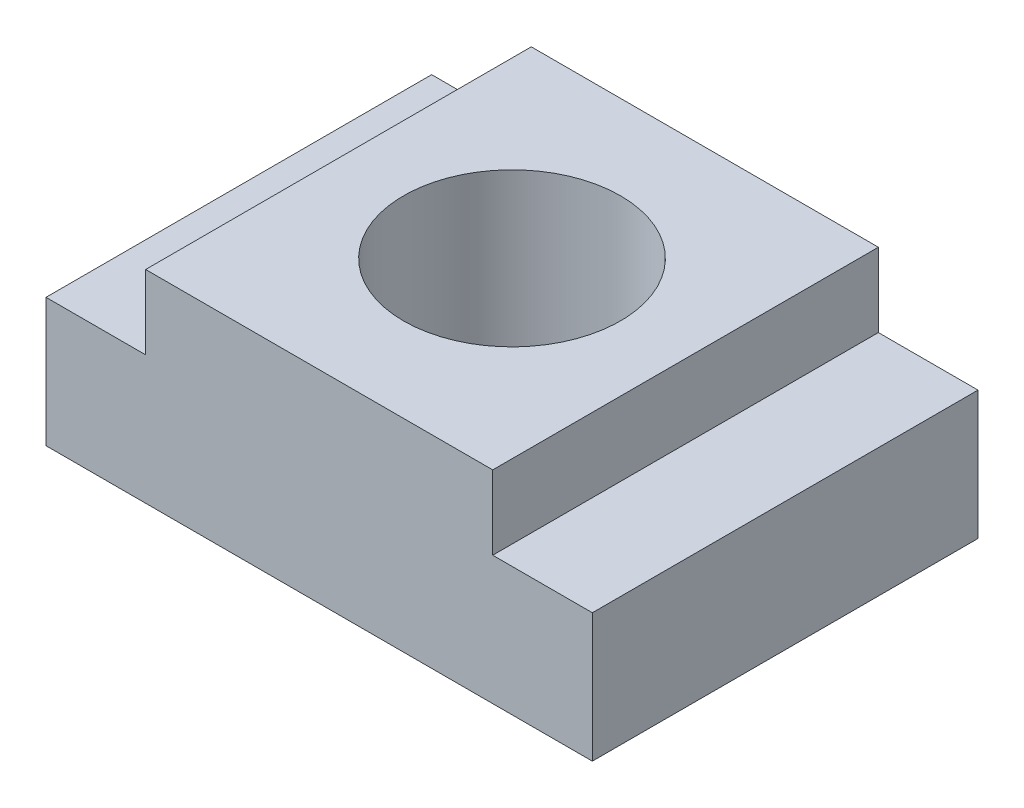
ISO-10303-21;
HEADER;
FILE_DESCRIPTION(('STEP AP214'),'2;1');
FILE_NAME('part.step','',(''),(''),'','','');
FILE_SCHEMA(('AUTOMOTIVE_DESIGN { 1 0 10303 214 1 1 1 1 }'));
ENDSEC;
DATA;
#1=APPLICATION_CONTEXT('core data for automotive mechanical design processes');
#2=APPLICATION_PROTOCOL_DEFINITION('international standard','automotive_design',2000,#1);
#3=PRODUCT_CONTEXT('',#1,'mechanical');
#4=PRODUCT('Part','Part','',(#3));
#5=PRODUCT_RELATED_PRODUCT_CATEGORY('part','',(#4));
#6=PRODUCT_DEFINITION_FORMATION('','',#4);
#7=PRODUCT_DEFINITION_CONTEXT('part definition',#1,'design');
#8=PRODUCT_DEFINITION('design','',#6,#7);
#9=PRODUCT_DEFINITION_SHAPE('','',#8);
#10=(LENGTH_UNIT() NAMED_UNIT(*) SI_UNIT(.MILLI.,.METRE.));
#11=(NAMED_UNIT(*) PLANE_ANGLE_UNIT() SI_UNIT($,.RADIAN.));
#12=(NAMED_UNIT(*) SI_UNIT($,.STERADIAN.) SOLID_ANGLE_UNIT());
#13=UNCERTAINTY_MEASURE_WITH_UNIT(LENGTH_MEASURE(1.E-05),#10,'distance_accuracy_value','');
#14=(GEOMETRIC_REPRESENTATION_CONTEXT(3) GLOBAL_UNCERTAINTY_ASSIGNED_CONTEXT((#13)) GLOBAL_UNIT_ASSIGNED_CONTEXT((#10,
#11,#12)) REPRESENTATION_CONTEXT('',''));
#15=CARTESIAN_POINT('',(0.,0.,0.));
#16=DIRECTION('',(0.,0.,1.));
#17=DIRECTION('',(1.,0.,0.));
#18=AXIS2_PLACEMENT_3D('',#15,#16,#17);
#19=CARTESIAN_POINT('',(8.5,0.,12.));
#20=DIRECTION('',(0.,1.,0.));
#21=DIRECTION('',(0.,0.,1.));
#22=AXIS2_PLACEMENT_3D('',#19,#20,#21);
#23=PLANE('',#22);
#24=CARTESIAN_POINT('',(0.,0.,6.));
#25=DIRECTION('',(0.,1.,0.));
#26=DIRECTION('',(0.,0.,1.));
#27=AXIS2_PLACEMENT_3D('',#24,#25,#26);
#28=CIRCLE('',#27,3.375);
#29=CARTESIAN_POINT('',(0.,0.,9.375));
#30=VERTEX_POINT('',#29);
#31=EDGE_CURVE('E136',#30,#30,#28,.T.);
#32=ORIENTED_EDGE('',*,*,#31,.T.);
#33=EDGE_LOOP('',(#32));
#34=FACE_BOUND('',#33,.T.);
#35=DIRECTION('',(1.,0.,0.));
#36=VECTOR('',#35,1.);
#37=CARTESIAN_POINT('',(8.5,0.,0.));
#38=LINE('',#37,#36);
#39=CARTESIAN_POINT('',(-8.5,0.,0.));
#40=VERTEX_POINT('',#39);
#41=CARTESIAN_POINT('',(8.5,0.,0.));
#42=VERTEX_POINT('',#41);
#43=EDGE_CURVE('E123',#40,#42,#38,.T.);
#44=ORIENTED_EDGE('',*,*,#43,.T.);
#45=DIRECTION('',(0.,0.,-1.));
#46=VECTOR('',#45,1.);
#47=CARTESIAN_POINT('',(8.5,0.,12.));
#48=LINE('',#47,#46);
#49=CARTESIAN_POINT('',(8.5,0.,12.));
#50=VERTEX_POINT('',#49);
#51=EDGE_CURVE('E11',#50,#42,#48,.T.);
#52=ORIENTED_EDGE('',*,*,#51,.F.);
#53=DIRECTION('',(1.,0.,0.));
#54=VECTOR('',#53,1.);
#55=CARTESIAN_POINT('',(8.5,0.,12.));
#56=LINE('',#55,#54);
#57=CARTESIAN_POINT('',(-8.5,0.,12.));
#58=VERTEX_POINT('',#57);
#59=EDGE_CURVE('E80',#58,#50,#56,.T.);
#60=ORIENTED_EDGE('',*,*,#59,.F.);
#61=DIRECTION('',(0.,0.,-1.));
#62=VECTOR('',#61,1.);
#63=CARTESIAN_POINT('',(-8.5,0.,12.));
#64=LINE('',#63,#62);
#65=EDGE_CURVE('E141',#58,#40,#64,.T.);
#66=ORIENTED_EDGE('',*,*,#65,.T.);
#67=EDGE_LOOP('',(#44,#52,#60,#66));
#68=FACE_BOUND('',#67,.T.);
#69=ADVANCED_FACE('F33',(#34,#68),#23,.F.);
#70=CARTESIAN_POINT('',(8.5,4.,12.));
#71=DIRECTION('',(-1.,0.,0.));
#72=DIRECTION('',(0.,0.,1.));
#73=AXIS2_PLACEMENT_3D('',#70,#71,#72);
#74=PLANE('',#73);
#75=DIRECTION('',(0.,1.,0.));
#76=VECTOR('',#75,1.);
#77=CARTESIAN_POINT('',(8.5,4.,0.));
#78=LINE('',#77,#76);
#79=CARTESIAN_POINT('',(8.5,4.,0.));
#80=VERTEX_POINT('',#79);
#81=EDGE_CURVE('E158',#42,#80,#78,.T.);
#82=ORIENTED_EDGE('',*,*,#81,.T.);
#83=DIRECTION('',(0.,0.,-1.));
#84=VECTOR('',#83,1.);
#85=CARTESIAN_POINT('',(8.5,4.,12.));
#86=LINE('',#85,#84);
#87=CARTESIAN_POINT('',(8.5,4.,12.));
#88=VERTEX_POINT('',#87);
#89=EDGE_CURVE('E41',#88,#80,#86,.T.);
#90=ORIENTED_EDGE('',*,*,#89,.F.);
#91=DIRECTION('',(0.,1.,0.));
#92=VECTOR('',#91,1.);
#93=CARTESIAN_POINT('',(8.5,4.,12.));
#94=LINE('',#93,#92);
#95=EDGE_CURVE('E152',#50,#88,#94,.T.);
#96=ORIENTED_EDGE('',*,*,#95,.F.);
#97=ORIENTED_EDGE('',*,*,#51,.T.);
#98=EDGE_LOOP('',(#82,#90,#96,#97));
#99=FACE_BOUND('',#98,.T.);
#100=ADVANCED_FACE('F181',(#99),#74,.F.);
#101=CARTESIAN_POINT('',(5.4,4.,12.));
#102=DIRECTION('',(0.,-1.,0.));
#103=DIRECTION('',(0.,0.,-1.));
#104=AXIS2_PLACEMENT_3D('',#101,#102,#103);
#105=PLANE('',#104);
#106=DIRECTION('',(-1.,0.,0.));
#107=VECTOR('',#106,1.);
#108=CARTESIAN_POINT('',(5.4,4.,0.));
#109=LINE('',#108,#107);
#110=CARTESIAN_POINT('',(5.4,4.,0.));
#111=VERTEX_POINT('',#110);
#112=EDGE_CURVE('E67',#80,#111,#109,.T.);
#113=ORIENTED_EDGE('',*,*,#112,.T.);
#114=DIRECTION('',(0.,0.,-1.));
#115=VECTOR('',#114,1.);
#116=CARTESIAN_POINT('',(5.4,4.,12.));
#117=LINE('',#116,#115);
#118=CARTESIAN_POINT('',(5.4,4.,12.));
#119=VERTEX_POINT('',#118);
#120=EDGE_CURVE('E164',#119,#111,#117,.T.);
#121=ORIENTED_EDGE('',*,*,#120,.F.);
#122=DIRECTION('',(-1.,0.,0.));
#123=VECTOR('',#122,1.);
#124=CARTESIAN_POINT('',(5.4,4.,12.));
#125=LINE('',#124,#123);
#126=EDGE_CURVE('E154',#88,#119,#125,.T.);
#127=ORIENTED_EDGE('',*,*,#126,.F.);
#128=ORIENTED_EDGE('',*,*,#89,.T.);
#129=EDGE_LOOP('',(#113,#121,#127,#128));
#130=FACE_BOUND('',#129,.T.);
#131=ADVANCED_FACE('F167',(#130),#105,.F.);
#132=CARTESIAN_POINT('',(5.4,6.3,12.));
#133=DIRECTION('',(-1.,0.,0.));
#134=DIRECTION('',(0.,0.,1.));
#135=AXIS2_PLACEMENT_3D('',#132,#133,#134);
#136=PLANE('',#135);
#137=DIRECTION('',(0.,1.,0.));
#138=VECTOR('',#137,1.);
#139=CARTESIAN_POINT('',(5.4,6.3,0.));
#140=LINE('',#139,#138);
#141=CARTESIAN_POINT('',(5.4,6.3,0.));
#142=VERTEX_POINT('',#141);
#143=EDGE_CURVE('E73',#111,#142,#140,.T.);
#144=ORIENTED_EDGE('',*,*,#143,.T.);
#145=DIRECTION('',(0.,0.,-1.));
#146=VECTOR('',#145,1.);
#147=CARTESIAN_POINT('',(5.4,6.3,12.));
#148=LINE('',#147,#146);
#149=CARTESIAN_POINT('',(5.4,6.3,12.));
#150=VERTEX_POINT('',#149);
#151=EDGE_CURVE('E113',#150,#142,#148,.T.);
#152=ORIENTED_EDGE('',*,*,#151,.F.);
#153=DIRECTION('',(0.,1.,0.));
#154=VECTOR('',#153,1.);
#155=CARTESIAN_POINT('',(5.4,6.3,12.));
#156=LINE('',#155,#154);
#157=EDGE_CURVE('E49',#119,#150,#156,.T.);
#158=ORIENTED_EDGE('',*,*,#157,.F.);
#159=ORIENTED_EDGE('',*,*,#120,.T.);
#160=EDGE_LOOP('',(#144,#152,#158,#159));
#161=FACE_BOUND('',#160,.T.);
#162=ADVANCED_FACE('F182',(#161),#136,.F.);
#163=CARTESIAN_POINT('',(0.,6.3,12.));
#164=DIRECTION('',(0.,-1.,0.));
#165=DIRECTION('',(0.,0.,-1.));
#166=AXIS2_PLACEMENT_3D('',#163,#164,#165);
#167=PLANE('',#166);
#168=CARTESIAN_POINT('',(0.,6.3,6.));
#169=DIRECTION('',(0.,1.,0.));
#170=DIRECTION('',(0.,0.,1.));
#171=AXIS2_PLACEMENT_3D('',#168,#169,#170);
#172=CIRCLE('',#171,3.375);
#173=CARTESIAN_POINT('',(0.,6.3,9.375));
#174=VERTEX_POINT('',#173);
#175=EDGE_CURVE('E200',#174,#174,#172,.T.);
#176=ORIENTED_EDGE('',*,*,#175,.F.);
#177=EDGE_LOOP('',(#176));
#178=FACE_BOUND('',#177,.T.);
#179=DIRECTION('',(-1.,0.,0.));
#180=VECTOR('',#179,1.);
#181=CARTESIAN_POINT('',(0.,6.3,0.));
#182=LINE('',#181,#180);
#183=CARTESIAN_POINT('',(-5.4,6.3,0.));
#184=VERTEX_POINT('',#183);
#185=EDGE_CURVE('E119',#142,#184,#182,.T.);
#186=ORIENTED_EDGE('',*,*,#185,.T.);
#187=DIRECTION('',(0.,0.,-1.));
#188=VECTOR('',#187,1.);
#189=CARTESIAN_POINT('',(-5.4,6.3,12.));
#190=LINE('',#189,#188);
#191=CARTESIAN_POINT('',(-5.4,6.3,12.));
#192=VERTEX_POINT('',#191);
#193=EDGE_CURVE('E116',#192,#184,#190,.T.);
#194=ORIENTED_EDGE('',*,*,#193,.F.);
#195=DIRECTION('',(-1.,0.,0.));
#196=VECTOR('',#195,1.);
#197=CARTESIAN_POINT('',(0.,6.3,12.));
#198=LINE('',#197,#196);
#199=EDGE_CURVE('E105',#150,#192,#198,.T.);
#200=ORIENTED_EDGE('',*,*,#199,.F.);
#201=ORIENTED_EDGE('',*,*,#151,.T.);
#202=EDGE_LOOP('',(#186,#194,#200,#201));
#203=FACE_BOUND('',#202,.T.);
#204=ADVANCED_FACE('F117',(#178,#203),#167,.F.);
#205=CARTESIAN_POINT('',(0.,0.,12.));
#206=DIRECTION('',(0.,0.,-1.));
#207=DIRECTION('',(-1.,0.,0.));
#208=AXIS2_PLACEMENT_3D('',#205,#206,#207);
#209=PLANE('',#208);
#210=ORIENTED_EDGE('',*,*,#199,.T.);
#211=DIRECTION('',(0.,1.,0.));
#212=VECTOR('',#211,1.);
#213=CARTESIAN_POINT('',(-5.4,6.3,12.));
#214=LINE('',#213,#212);
#215=CARTESIAN_POINT('',(-5.4,4.,12.));
#216=VERTEX_POINT('',#215);
#217=EDGE_CURVE('E110',#216,#192,#214,.T.);
#218=ORIENTED_EDGE('',*,*,#217,.F.);
#219=DIRECTION('',(1.,0.,0.));
#220=VECTOR('',#219,1.);
#221=CARTESIAN_POINT('',(-5.4,4.,12.));
#222=LINE('',#221,#220);
#223=CARTESIAN_POINT('',(-8.5,4.,12.));
#224=VERTEX_POINT('',#223);
#225=EDGE_CURVE('E127',#224,#216,#222,.T.);
#226=ORIENTED_EDGE('',*,*,#225,.F.);
#227=DIRECTION('',(0.,1.,0.));
#228=VECTOR('',#227,1.);
#229=CARTESIAN_POINT('',(-8.5,4.,12.));
#230=LINE('',#229,#228);
#231=EDGE_CURVE('E130',#58,#224,#230,.T.);
#232=ORIENTED_EDGE('',*,*,#231,.F.);
#233=ORIENTED_EDGE('',*,*,#59,.T.);
#234=ORIENTED_EDGE('',*,*,#95,.T.);
#235=ORIENTED_EDGE('',*,*,#126,.T.);
#236=ORIENTED_EDGE('',*,*,#157,.T.);
#237=EDGE_LOOP('',(#210,#218,#226,#232,#233,#234,#235,#236));
#238=FACE_BOUND('',#237,.T.);
#239=ADVANCED_FACE('F107',(#238),#209,.F.);
#240=CARTESIAN_POINT('',(0.,0.,0.));
#241=DIRECTION('',(0.,0.,-1.));
#242=DIRECTION('',(-1.,0.,0.));
#243=AXIS2_PLACEMENT_3D('',#240,#241,#242);
#244=PLANE('',#243);
#245=ORIENTED_EDGE('',*,*,#43,.F.);
#246=DIRECTION('',(0.,1.,0.));
#247=VECTOR('',#246,1.);
#248=CARTESIAN_POINT('',(-8.5,4.,0.));
#249=LINE('',#248,#247);
#250=CARTESIAN_POINT('',(-8.5,4.,0.));
#251=VERTEX_POINT('',#250);
#252=EDGE_CURVE('E128',#40,#251,#249,.T.);
#253=ORIENTED_EDGE('',*,*,#252,.T.);
#254=DIRECTION('',(1.,0.,0.));
#255=VECTOR('',#254,1.);
#256=CARTESIAN_POINT('',(-5.4,4.,0.));
#257=LINE('',#256,#255);
#258=CARTESIAN_POINT('',(-5.4,4.,0.));
#259=VERTEX_POINT('',#258);
#260=EDGE_CURVE('E133',#251,#259,#257,.T.);
#261=ORIENTED_EDGE('',*,*,#260,.T.);
#262=DIRECTION('',(0.,1.,0.));
#263=VECTOR('',#262,1.);
#264=CARTESIAN_POINT('',(-5.4,6.3,0.));
#265=LINE('',#264,#263);
#266=EDGE_CURVE('E142',#259,#184,#265,.T.);
#267=ORIENTED_EDGE('',*,*,#266,.T.);
#268=ORIENTED_EDGE('',*,*,#185,.F.);
#269=ORIENTED_EDGE('',*,*,#143,.F.);
#270=ORIENTED_EDGE('',*,*,#112,.F.);
#271=ORIENTED_EDGE('',*,*,#81,.F.);
#272=EDGE_LOOP('',(#245,#253,#261,#267,#268,#269,#270,#271));
#273=FACE_BOUND('',#272,.T.);
#274=ADVANCED_FACE('F172',(#273),#244,.T.);
#275=CARTESIAN_POINT('',(-5.4,6.3,12.));
#276=DIRECTION('',(-1.,0.,0.));
#277=DIRECTION('',(0.,0.,1.));
#278=AXIS2_PLACEMENT_3D('',#275,#276,#277);
#279=PLANE('',#278);
#280=ORIENTED_EDGE('',*,*,#266,.F.);
#281=DIRECTION('',(0.,0.,-1.));
#282=VECTOR('',#281,1.);
#283=CARTESIAN_POINT('',(-5.4,4.,12.));
#284=LINE('',#283,#282);
#285=EDGE_CURVE('E124',#216,#259,#284,.T.);
#286=ORIENTED_EDGE('',*,*,#285,.F.);
#287=ORIENTED_EDGE('',*,*,#217,.T.);
#288=ORIENTED_EDGE('',*,*,#193,.T.);
#289=EDGE_LOOP('',(#280,#286,#287,#288));
#290=FACE_BOUND('',#289,.T.);
#291=ADVANCED_FACE('F126',(#290),#279,.T.);
#292=CARTESIAN_POINT('',(-5.4,4.,12.));
#293=DIRECTION('',(0.,1.,0.));
#294=DIRECTION('',(0.,0.,1.));
#295=AXIS2_PLACEMENT_3D('',#292,#293,#294);
#296=PLANE('',#295);
#297=ORIENTED_EDGE('',*,*,#260,.F.);
#298=DIRECTION('',(0.,0.,-1.));
#299=VECTOR('',#298,1.);
#300=CARTESIAN_POINT('',(-8.5,4.,12.));
#301=LINE('',#300,#299);
#302=EDGE_CURVE('E148',#224,#251,#301,.T.);
#303=ORIENTED_EDGE('',*,*,#302,.F.);
#304=ORIENTED_EDGE('',*,*,#225,.T.);
#305=ORIENTED_EDGE('',*,*,#285,.T.);
#306=EDGE_LOOP('',(#297,#303,#304,#305));
#307=FACE_BOUND('',#306,.T.);
#308=ADVANCED_FACE('F176',(#307),#296,.T.);
#309=CARTESIAN_POINT('',(-8.5,4.,12.));
#310=DIRECTION('',(-1.,0.,0.));
#311=DIRECTION('',(0.,0.,1.));
#312=AXIS2_PLACEMENT_3D('',#309,#310,#311);
#313=PLANE('',#312);
#314=ORIENTED_EDGE('',*,*,#252,.F.);
#315=ORIENTED_EDGE('',*,*,#65,.F.);
#316=ORIENTED_EDGE('',*,*,#231,.T.);
#317=ORIENTED_EDGE('',*,*,#302,.T.);
#318=EDGE_LOOP('',(#314,#315,#316,#317));
#319=FACE_BOUND('',#318,.T.);
#320=ADVANCED_FACE('F179',(#319),#313,.T.);
#321=CARTESIAN_POINT('',(0.,-0.7,6.));
#322=DIRECTION('',(0.,1.,0.));
#323=DIRECTION('',(0.,0.,1.));
#324=AXIS2_PLACEMENT_3D('',#321,#322,#323);
#325=CYLINDRICAL_SURFACE('',#324,3.375);
#326=ORIENTED_EDGE('',*,*,#175,.T.);
#327=EDGE_LOOP('',(#326));
#328=FACE_BOUND('',#327,.T.);
#329=ORIENTED_EDGE('',*,*,#31,.F.);
#330=EDGE_LOOP('',(#329));
#331=FACE_BOUND('',#330,.T.);
#332=ADVANCED_FACE('F204',(#328,#331),#325,.F.);
#333=CLOSED_SHELL('',(#69,#100,#131,#162,#204,#239,#274,#291,#308,#320,#332));
#334=MANIFOLD_SOLID_BREP('B2',#333);
#335=ADVANCED_BREP_SHAPE_REPRESENTATION('',(#18,#334),#14);
#336=SHAPE_DEFINITION_REPRESENTATION(#9,#335);
ENDSEC;
END-ISO-10303-21;
